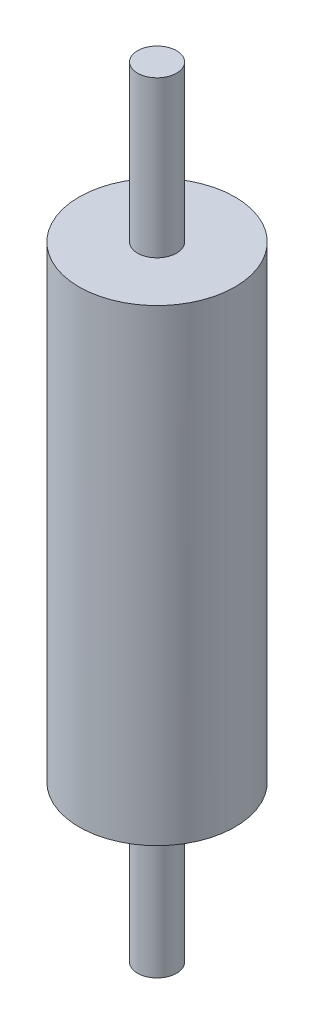
ISO-10303-21;
HEADER;
FILE_DESCRIPTION(('STEP AP214'),'2;1');
FILE_NAME('part.step','',(''),(''),'','','');
FILE_SCHEMA(('AUTOMOTIVE_DESIGN { 1 0 10303 214 1 1 1 1 }'));
ENDSEC;
DATA;
#1=APPLICATION_CONTEXT('core data for automotive mechanical design processes');
#2=APPLICATION_PROTOCOL_DEFINITION('international standard','automotive_design',2000,#1);
#3=PRODUCT_CONTEXT('',#1,'mechanical');
#4=PRODUCT('Part','Part','',(#3));
#5=PRODUCT_RELATED_PRODUCT_CATEGORY('part','',(#4));
#6=PRODUCT_DEFINITION_FORMATION('','',#4);
#7=PRODUCT_DEFINITION_CONTEXT('part definition',#1,'design');
#8=PRODUCT_DEFINITION('design','',#6,#7);
#9=PRODUCT_DEFINITION_SHAPE('','',#8);
#10=(LENGTH_UNIT() NAMED_UNIT(*) SI_UNIT(.MILLI.,.METRE.));
#11=(NAMED_UNIT(*) PLANE_ANGLE_UNIT() SI_UNIT($,.RADIAN.));
#12=(NAMED_UNIT(*) SI_UNIT($,.STERADIAN.) SOLID_ANGLE_UNIT());
#13=UNCERTAINTY_MEASURE_WITH_UNIT(LENGTH_MEASURE(1.E-05),#10,'distance_accuracy_value','');
#14=(GEOMETRIC_REPRESENTATION_CONTEXT(3) GLOBAL_UNCERTAINTY_ASSIGNED_CONTEXT((#13)) GLOBAL_UNIT_ASSIGNED_CONTEXT((#10,
#11,#12)) REPRESENTATION_CONTEXT('',''));
#15=CARTESIAN_POINT('',(0.,0.,0.));
#16=DIRECTION('',(0.,0.,1.));
#17=DIRECTION('',(1.,0.,0.));
#18=AXIS2_PLACEMENT_3D('',#15,#16,#17);
#19=CARTESIAN_POINT('',(0.,100.,0.));
#20=DIRECTION('',(0.,-1.,0.));
#21=DIRECTION('',(0.,0.,-1.));
#22=AXIS2_PLACEMENT_3D('',#19,#20,#21);
#23=CYLINDRICAL_SURFACE('',#22,10.);
#24=CARTESIAN_POINT('',(0.,80.,0.));
#25=DIRECTION('',(0.,1.,0.));
#26=DIRECTION('',(0.,0.,1.));
#27=AXIS2_PLACEMENT_3D('',#24,#25,#26);
#28=CIRCLE('',#27,10.);
#29=CARTESIAN_POINT('',(0.,80.,10.));
#30=VERTEX_POINT('',#29);
#31=EDGE_CURVE('E10',#30,#30,#28,.T.);
#32=ORIENTED_EDGE('',*,*,#31,.F.);
#33=EDGE_LOOP('',(#32));
#34=FACE_BOUND('',#33,.T.);
#35=CARTESIAN_POINT('',(0.,20.,0.));
#36=DIRECTION('',(0.,-1.,0.));
#37=DIRECTION('',(0.,0.,-1.));
#38=AXIS2_PLACEMENT_3D('',#35,#36,#37);
#39=CIRCLE('',#38,10.);
#40=CARTESIAN_POINT('',(0.,20.,-10.));
#41=VERTEX_POINT('',#40);
#42=EDGE_CURVE('E55',#41,#41,#39,.T.);
#43=ORIENTED_EDGE('',*,*,#42,.F.);
#44=EDGE_LOOP('',(#43));
#45=FACE_BOUND('',#44,.T.);
#46=ADVANCED_FACE('F37',(#34,#45),#23,.T.);
#47=CARTESIAN_POINT('',(0.,80.,0.));
#48=DIRECTION('',(0.,1.,0.));
#49=DIRECTION('',(0.,0.,1.));
#50=AXIS2_PLACEMENT_3D('',#47,#48,#49);
#51=PLANE('',#50);
#52=CARTESIAN_POINT('',(0.,80.,0.));
#53=DIRECTION('',(0.,1.,0.));
#54=DIRECTION('',(0.,0.,1.));
#55=AXIS2_PLACEMENT_3D('',#52,#53,#54);
#56=CIRCLE('',#55,2.5);
#57=CARTESIAN_POINT('',(0.,80.,2.5));
#58=VERTEX_POINT('',#57);
#59=EDGE_CURVE('E44',#58,#58,#56,.T.);
#60=ORIENTED_EDGE('',*,*,#59,.F.);
#61=EDGE_LOOP('',(#60));
#62=FACE_BOUND('',#61,.T.);
#63=ORIENTED_EDGE('',*,*,#31,.T.);
#64=EDGE_LOOP('',(#63));
#65=FACE_BOUND('',#64,.T.);
#66=ADVANCED_FACE('F80',(#62,#65),#51,.T.);
#67=CARTESIAN_POINT('',(0.,80.,0.));
#68=DIRECTION('',(0.,1.,0.));
#69=DIRECTION('',(0.,0.,1.));
#70=AXIS2_PLACEMENT_3D('',#67,#68,#69);
#71=CYLINDRICAL_SURFACE('',#70,2.5);
#72=ORIENTED_EDGE('',*,*,#59,.T.);
#73=EDGE_LOOP('',(#72));
#74=FACE_BOUND('',#73,.T.);
#75=CARTESIAN_POINT('',(0.,100.,0.));
#76=DIRECTION('',(0.,1.,0.));
#77=DIRECTION('',(0.,0.,1.));
#78=AXIS2_PLACEMENT_3D('',#75,#76,#77);
#79=CIRCLE('',#78,2.5);
#80=CARTESIAN_POINT('',(0.,100.,2.5));
#81=VERTEX_POINT('',#80);
#82=EDGE_CURVE('E49',#81,#81,#79,.T.);
#83=ORIENTED_EDGE('',*,*,#82,.F.);
#84=EDGE_LOOP('',(#83));
#85=FACE_BOUND('',#84,.T.);
#86=ADVANCED_FACE('F85',(#74,#85),#71,.T.);
#87=CARTESIAN_POINT('',(0.,100.,0.));
#88=DIRECTION('',(0.,1.,0.));
#89=DIRECTION('',(0.,0.,1.));
#90=AXIS2_PLACEMENT_3D('',#87,#88,#89);
#91=PLANE('',#90);
#92=ORIENTED_EDGE('',*,*,#82,.T.);
#93=EDGE_LOOP('',(#92));
#94=FACE_BOUND('',#93,.T.);
#95=ADVANCED_FACE('F75',(#94),#91,.T.);
#96=CARTESIAN_POINT('',(0.,20.,0.));
#97=DIRECTION('',(0.,-1.,0.));
#98=DIRECTION('',(0.,0.,-1.));
#99=AXIS2_PLACEMENT_3D('',#96,#97,#98);
#100=PLANE('',#99);
#101=CARTESIAN_POINT('',(0.,20.,0.));
#102=DIRECTION('',(0.,-1.,0.));
#103=DIRECTION('',(0.,0.,-1.));
#104=AXIS2_PLACEMENT_3D('',#101,#102,#103);
#105=CIRCLE('',#104,2.5);
#106=CARTESIAN_POINT('',(0.,20.,-2.5));
#107=VERTEX_POINT('',#106);
#108=EDGE_CURVE('E60',#107,#107,#105,.T.);
#109=ORIENTED_EDGE('',*,*,#108,.F.);
#110=EDGE_LOOP('',(#109));
#111=FACE_BOUND('',#110,.T.);
#112=ORIENTED_EDGE('',*,*,#42,.T.);
#113=EDGE_LOOP('',(#112));
#114=FACE_BOUND('',#113,.T.);
#115=ADVANCED_FACE('F72',(#111,#114),#100,.T.);
#116=CARTESIAN_POINT('',(0.,20.,0.));
#117=DIRECTION('',(0.,-1.,0.));
#118=DIRECTION('',(0.,0.,-1.));
#119=AXIS2_PLACEMENT_3D('',#116,#117,#118);
#120=CYLINDRICAL_SURFACE('',#119,2.5);
#121=ORIENTED_EDGE('',*,*,#108,.T.);
#122=EDGE_LOOP('',(#121));
#123=FACE_BOUND('',#122,.T.);
#124=CARTESIAN_POINT('',(0.,0.,0.));
#125=DIRECTION('',(0.,-1.,0.));
#126=DIRECTION('',(0.,0.,-1.));
#127=AXIS2_PLACEMENT_3D('',#124,#125,#126);
#128=CIRCLE('',#127,2.5);
#129=CARTESIAN_POINT('',(0.,0.,-2.5));
#130=VERTEX_POINT('',#129);
#131=EDGE_CURVE('E61',#130,#130,#128,.T.);
#132=ORIENTED_EDGE('',*,*,#131,.F.);
#133=EDGE_LOOP('',(#132));
#134=FACE_BOUND('',#133,.T.);
#135=ADVANCED_FACE('F69',(#123,#134),#120,.T.);
#136=CARTESIAN_POINT('',(0.,0.,0.));
#137=DIRECTION('',(0.,1.,0.));
#138=DIRECTION('',(0.,0.,1.));
#139=AXIS2_PLACEMENT_3D('',#136,#137,#138);
#140=PLANE('',#139);
#141=ORIENTED_EDGE('',*,*,#131,.T.);
#142=EDGE_LOOP('',(#141));
#143=FACE_BOUND('',#142,.T.);
#144=ADVANCED_FACE('F95',(#143),#140,.F.);
#145=CLOSED_SHELL('',(#46,#66,#86,#95,#115,#135,#144));
#146=MANIFOLD_SOLID_BREP('B2',#145);
#147=ADVANCED_BREP_SHAPE_REPRESENTATION('',(#18,#146),#14);
#148=SHAPE_DEFINITION_REPRESENTATION(#9,#147);
ENDSEC;
END-ISO-10303-21;
